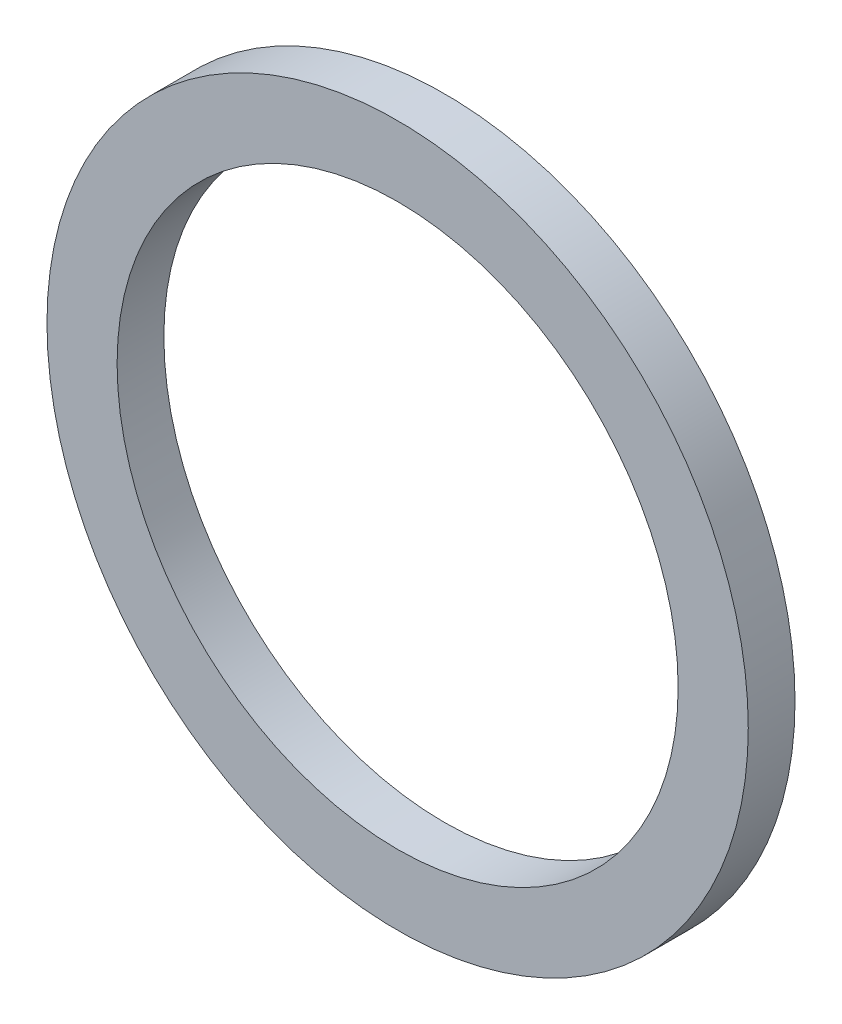
ISO-10303-21;
HEADER;
FILE_DESCRIPTION(('STEP AP214'),'2;1');
FILE_NAME('part.step','',(''),(''),'','','');
FILE_SCHEMA(('AUTOMOTIVE_DESIGN { 1 0 10303 214 1 1 1 1 }'));
ENDSEC;
DATA;
#1=APPLICATION_CONTEXT('core data for automotive mechanical design processes');
#2=APPLICATION_PROTOCOL_DEFINITION('international standard','automotive_design',2000,#1);
#3=PRODUCT_CONTEXT('',#1,'mechanical');
#4=PRODUCT('Part','Part','',(#3));
#5=PRODUCT_RELATED_PRODUCT_CATEGORY('part','',(#4));
#6=PRODUCT_DEFINITION_FORMATION('','',#4);
#7=PRODUCT_DEFINITION_CONTEXT('part definition',#1,'design');
#8=PRODUCT_DEFINITION('design','',#6,#7);
#9=PRODUCT_DEFINITION_SHAPE('','',#8);
#10=(LENGTH_UNIT() NAMED_UNIT(*) SI_UNIT(.MILLI.,.METRE.));
#11=(NAMED_UNIT(*) PLANE_ANGLE_UNIT() SI_UNIT($,.RADIAN.));
#12=(NAMED_UNIT(*) SI_UNIT($,.STERADIAN.) SOLID_ANGLE_UNIT());
#13=UNCERTAINTY_MEASURE_WITH_UNIT(LENGTH_MEASURE(1.E-05),#10,'distance_accuracy_value','');
#14=(GEOMETRIC_REPRESENTATION_CONTEXT(3) GLOBAL_UNCERTAINTY_ASSIGNED_CONTEXT((#13)) GLOBAL_UNIT_ASSIGNED_CONTEXT((#10,
#11,#12)) REPRESENTATION_CONTEXT('',''));
#15=CARTESIAN_POINT('',(0.,0.,0.));
#16=DIRECTION('',(0.,0.,1.));
#17=DIRECTION('',(1.,0.,0.));
#18=AXIS2_PLACEMENT_3D('',#15,#16,#17);
#19=CARTESIAN_POINT('',(0.,0.,2.));
#20=DIRECTION('',(0.,0.,-1.));
#21=DIRECTION('',(-1.,0.,0.));
#22=AXIS2_PLACEMENT_3D('',#19,#20,#21);
#23=CYLINDRICAL_SURFACE('',#22,15.);
#24=CARTESIAN_POINT('',(0.,0.,2.));
#25=DIRECTION('',(0.,0.,1.));
#26=DIRECTION('',(1.,0.,0.));
#27=AXIS2_PLACEMENT_3D('',#24,#25,#26);
#28=CIRCLE('',#27,15.);
#29=CARTESIAN_POINT('',(15.,0.,2.));
#30=VERTEX_POINT('',#29);
#31=EDGE_CURVE('E10',#30,#30,#28,.T.);
#32=ORIENTED_EDGE('',*,*,#31,.F.);
#33=EDGE_LOOP('',(#32));
#34=FACE_BOUND('',#33,.T.);
#35=CARTESIAN_POINT('',(0.,0.,0.));
#36=DIRECTION('',(0.,0.,1.));
#37=DIRECTION('',(1.,0.,0.));
#38=AXIS2_PLACEMENT_3D('',#35,#36,#37);
#39=CIRCLE('',#38,15.);
#40=CARTESIAN_POINT('',(15.,0.,0.));
#41=VERTEX_POINT('',#40);
#42=EDGE_CURVE('E34',#41,#41,#39,.T.);
#43=ORIENTED_EDGE('',*,*,#42,.T.);
#44=EDGE_LOOP('',(#43));
#45=FACE_BOUND('',#44,.T.);
#46=ADVANCED_FACE('F31',(#34,#45),#23,.T.);
#47=CARTESIAN_POINT('',(0.,0.,2.));
#48=DIRECTION('',(0.,0.,1.));
#49=DIRECTION('',(1.,0.,0.));
#50=AXIS2_PLACEMENT_3D('',#47,#48,#49);
#51=PLANE('',#50);
#52=CARTESIAN_POINT('',(0.,0.,2.));
#53=DIRECTION('',(0.,0.,1.));
#54=DIRECTION('',(1.,0.,0.));
#55=AXIS2_PLACEMENT_3D('',#52,#53,#54);
#56=CIRCLE('',#55,12.);
#57=CARTESIAN_POINT('',(12.,0.,2.));
#58=VERTEX_POINT('',#57);
#59=EDGE_CURVE('E43',#58,#58,#56,.T.);
#60=ORIENTED_EDGE('',*,*,#59,.F.);
#61=EDGE_LOOP('',(#60));
#62=FACE_BOUND('',#61,.T.);
#63=ORIENTED_EDGE('',*,*,#31,.T.);
#64=EDGE_LOOP('',(#63));
#65=FACE_BOUND('',#64,.T.);
#66=ADVANCED_FACE('F58',(#62,#65),#51,.T.);
#67=CARTESIAN_POINT('',(0.,0.,0.));
#68=DIRECTION('',(0.,0.,1.));
#69=DIRECTION('',(1.,0.,0.));
#70=AXIS2_PLACEMENT_3D('',#67,#68,#69);
#71=PLANE('',#70);
#72=CARTESIAN_POINT('',(0.,0.,0.));
#73=DIRECTION('',(0.,0.,1.));
#74=DIRECTION('',(1.,0.,0.));
#75=AXIS2_PLACEMENT_3D('',#72,#73,#74);
#76=CIRCLE('',#75,12.);
#77=CARTESIAN_POINT('',(12.,0.,0.));
#78=VERTEX_POINT('',#77);
#79=EDGE_CURVE('E41',#78,#78,#76,.T.);
#80=ORIENTED_EDGE('',*,*,#79,.T.);
#81=EDGE_LOOP('',(#80));
#82=FACE_BOUND('',#81,.T.);
#83=ORIENTED_EDGE('',*,*,#42,.F.);
#84=EDGE_LOOP('',(#83));
#85=FACE_BOUND('',#84,.T.);
#86=ADVANCED_FACE('F49',(#82,#85),#71,.F.);
#87=CARTESIAN_POINT('',(0.,0.,0.));
#88=DIRECTION('',(0.,0.,1.));
#89=DIRECTION('',(1.,0.,0.));
#90=AXIS2_PLACEMENT_3D('',#87,#88,#89);
#91=CYLINDRICAL_SURFACE('',#90,12.);
#92=ORIENTED_EDGE('',*,*,#79,.F.);
#93=EDGE_LOOP('',(#92));
#94=FACE_BOUND('',#93,.T.);
#95=ORIENTED_EDGE('',*,*,#59,.T.);
#96=EDGE_LOOP('',(#95));
#97=FACE_BOUND('',#96,.T.);
#98=ADVANCED_FACE('F52',(#94,#97),#91,.F.);
#99=CLOSED_SHELL('',(#46,#66,#86,#98));
#100=MANIFOLD_SOLID_BREP('B2',#99);
#101=ADVANCED_BREP_SHAPE_REPRESENTATION('',(#18,#100),#14);
#102=SHAPE_DEFINITION_REPRESENTATION(#9,#101);
ENDSEC;
END-ISO-10303-21;
